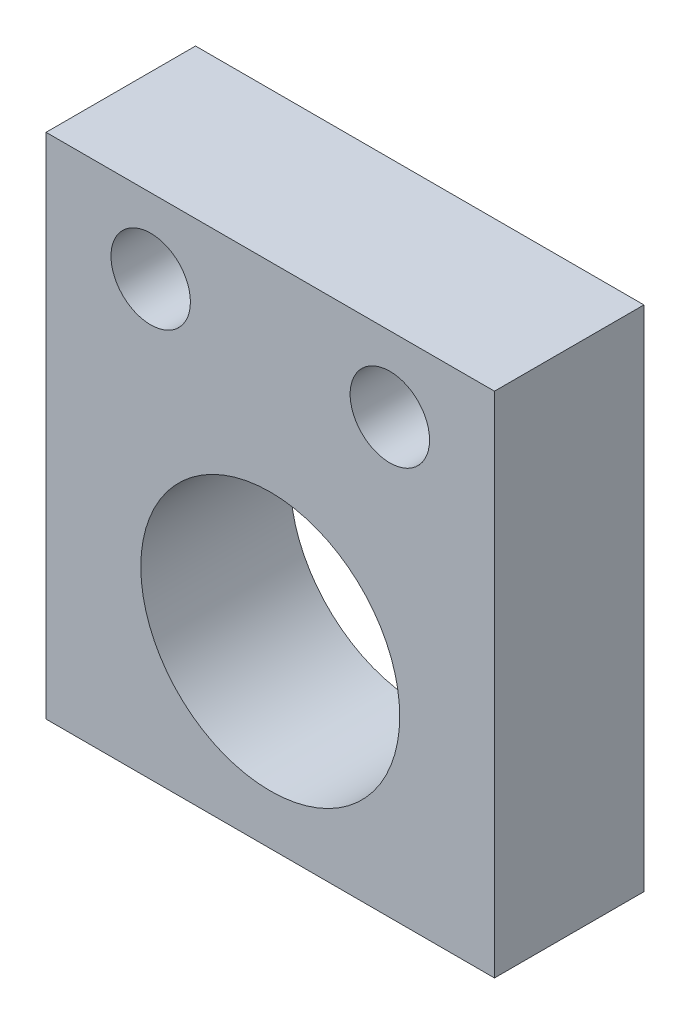
ISO-10303-21;
HEADER;
FILE_DESCRIPTION(('STEP AP214'),'2;1');
FILE_NAME('part.step','',(''),(''),'','','');
FILE_SCHEMA(('AUTOMOTIVE_DESIGN { 1 0 10303 214 1 1 1 1 }'));
ENDSEC;
DATA;
#1=APPLICATION_CONTEXT('core data for automotive mechanical design processes');
#2=APPLICATION_PROTOCOL_DEFINITION('international standard','automotive_design',2000,#1);
#3=PRODUCT_CONTEXT('',#1,'mechanical');
#4=PRODUCT('Part','Part','',(#3));
#5=PRODUCT_RELATED_PRODUCT_CATEGORY('part','',(#4));
#6=PRODUCT_DEFINITION_FORMATION('','',#4);
#7=PRODUCT_DEFINITION_CONTEXT('part definition',#1,'design');
#8=PRODUCT_DEFINITION('design','',#6,#7);
#9=PRODUCT_DEFINITION_SHAPE('','',#8);
#10=(LENGTH_UNIT() NAMED_UNIT(*) SI_UNIT(.MILLI.,.METRE.));
#11=(NAMED_UNIT(*) PLANE_ANGLE_UNIT() SI_UNIT($,.RADIAN.));
#12=(NAMED_UNIT(*) SI_UNIT($,.STERADIAN.) SOLID_ANGLE_UNIT());
#13=UNCERTAINTY_MEASURE_WITH_UNIT(LENGTH_MEASURE(1.E-05),#10,'distance_accuracy_value','');
#14=(GEOMETRIC_REPRESENTATION_CONTEXT(3) GLOBAL_UNCERTAINTY_ASSIGNED_CONTEXT((#13)) GLOBAL_UNIT_ASSIGNED_CONTEXT((#10,
#11,#12)) REPRESENTATION_CONTEXT('',''));
#15=CARTESIAN_POINT('',(0.,0.,0.));
#16=DIRECTION('',(0.,0.,1.));
#17=DIRECTION('',(1.,0.,0.));
#18=AXIS2_PLACEMENT_3D('',#15,#16,#17);
#19=CARTESIAN_POINT('',(0.,0.,-12.7));
#20=DIRECTION('',(-1.,0.,0.));
#21=DIRECTION('',(0.,0.,1.));
#22=AXIS2_PLACEMENT_3D('',#19,#20,#21);
#23=PLANE('',#22);
#24=DIRECTION('',(0.,-1.,0.));
#25=VECTOR('',#24,1.);
#26=CARTESIAN_POINT('',(0.,0.,0.));
#27=LINE('',#26,#25);
#28=CARTESIAN_POINT('',(0.,43.18,0.));
#29=VERTEX_POINT('',#28);
#30=CARTESIAN_POINT('',(0.,0.,0.));
#31=VERTEX_POINT('',#30);
#32=EDGE_CURVE('E114',#29,#31,#27,.T.);
#33=ORIENTED_EDGE('',*,*,#32,.F.);
#34=DIRECTION('',(0.,0.,1.));
#35=VECTOR('',#34,1.);
#36=CARTESIAN_POINT('',(0.,43.18,-12.7));
#37=LINE('',#36,#35);
#38=CARTESIAN_POINT('',(0.,43.18,-12.7));
#39=VERTEX_POINT('',#38);
#40=EDGE_CURVE('E11',#39,#29,#37,.T.);
#41=ORIENTED_EDGE('',*,*,#40,.F.);
#42=DIRECTION('',(0.,-1.,0.));
#43=VECTOR('',#42,1.);
#44=CARTESIAN_POINT('',(0.,0.,-12.7));
#45=LINE('',#44,#43);
#46=CARTESIAN_POINT('',(0.,0.,-12.7));
#47=VERTEX_POINT('',#46);
#48=EDGE_CURVE('E105',#39,#47,#45,.T.);
#49=ORIENTED_EDGE('',*,*,#48,.T.);
#50=DIRECTION('',(0.,0.,1.));
#51=VECTOR('',#50,1.);
#52=CARTESIAN_POINT('',(0.,0.,-12.7));
#53=LINE('',#52,#51);
#54=EDGE_CURVE('E46',#47,#31,#53,.T.);
#55=ORIENTED_EDGE('',*,*,#54,.T.);
#56=EDGE_LOOP('',(#33,#41,#49,#55));
#57=FACE_BOUND('',#56,.T.);
#58=ADVANCED_FACE('F43',(#57),#23,.T.);
#59=CARTESIAN_POINT('',(0.,43.18,-12.7));
#60=DIRECTION('',(0.,1.,0.));
#61=DIRECTION('',(0.,0.,1.));
#62=AXIS2_PLACEMENT_3D('',#59,#60,#61);
#63=PLANE('',#62);
#64=DIRECTION('',(-1.,0.,0.));
#65=VECTOR('',#64,1.);
#66=CARTESIAN_POINT('',(0.,43.18,0.));
#67=LINE('',#66,#65);
#68=CARTESIAN_POINT('',(38.1,43.18,0.));
#69=VERTEX_POINT('',#68);
#70=EDGE_CURVE('E108',#69,#29,#67,.T.);
#71=ORIENTED_EDGE('',*,*,#70,.F.);
#72=DIRECTION('',(0.,0.,1.));
#73=VECTOR('',#72,1.);
#74=CARTESIAN_POINT('',(38.1,43.18,-12.7));
#75=LINE('',#74,#73);
#76=CARTESIAN_POINT('',(38.1,43.18,-12.7));
#77=VERTEX_POINT('',#76);
#78=EDGE_CURVE('E53',#77,#69,#75,.T.);
#79=ORIENTED_EDGE('',*,*,#78,.F.);
#80=DIRECTION('',(-1.,0.,0.));
#81=VECTOR('',#80,1.);
#82=CARTESIAN_POINT('',(0.,43.18,-12.7));
#83=LINE('',#82,#81);
#84=EDGE_CURVE('E100',#77,#39,#83,.T.);
#85=ORIENTED_EDGE('',*,*,#84,.T.);
#86=ORIENTED_EDGE('',*,*,#40,.T.);
#87=EDGE_LOOP('',(#71,#79,#85,#86));
#88=FACE_BOUND('',#87,.T.);
#89=ADVANCED_FACE('F131',(#88),#63,.T.);
#90=CARTESIAN_POINT('',(38.1,0.,-12.7));
#91=DIRECTION('',(1.,0.,0.));
#92=DIRECTION('',(0.,0.,-1.));
#93=AXIS2_PLACEMENT_3D('',#90,#91,#92);
#94=PLANE('',#93);
#95=DIRECTION('',(0.,1.,0.));
#96=VECTOR('',#95,1.);
#97=CARTESIAN_POINT('',(38.1,0.,0.));
#98=LINE('',#97,#96);
#99=CARTESIAN_POINT('',(38.1,0.,0.));
#100=VERTEX_POINT('',#99);
#101=EDGE_CURVE('E94',#100,#69,#98,.T.);
#102=ORIENTED_EDGE('',*,*,#101,.F.);
#103=DIRECTION('',(0.,0.,1.));
#104=VECTOR('',#103,1.);
#105=CARTESIAN_POINT('',(38.1,0.,-12.7));
#106=LINE('',#105,#104);
#107=CARTESIAN_POINT('',(38.1,0.,-12.7));
#108=VERTEX_POINT('',#107);
#109=EDGE_CURVE('E89',#108,#100,#106,.T.);
#110=ORIENTED_EDGE('',*,*,#109,.F.);
#111=DIRECTION('',(0.,1.,0.));
#112=VECTOR('',#111,1.);
#113=CARTESIAN_POINT('',(38.1,0.,-12.7));
#114=LINE('',#113,#112);
#115=EDGE_CURVE('E92',#108,#77,#114,.T.);
#116=ORIENTED_EDGE('',*,*,#115,.T.);
#117=ORIENTED_EDGE('',*,*,#78,.T.);
#118=EDGE_LOOP('',(#102,#110,#116,#117));
#119=FACE_BOUND('',#118,.T.);
#120=ADVANCED_FACE('F91',(#119),#94,.T.);
#121=CARTESIAN_POINT('',(0.,0.,-12.7));
#122=DIRECTION('',(0.,-1.,0.));
#123=DIRECTION('',(0.,0.,-1.));
#124=AXIS2_PLACEMENT_3D('',#121,#122,#123);
#125=PLANE('',#124);
#126=DIRECTION('',(1.,0.,0.));
#127=VECTOR('',#126,1.);
#128=CARTESIAN_POINT('',(0.,0.,0.));
#129=LINE('',#128,#127);
#130=EDGE_CURVE('E118',#31,#100,#129,.T.);
#131=ORIENTED_EDGE('',*,*,#130,.F.);
#132=ORIENTED_EDGE('',*,*,#54,.F.);
#133=DIRECTION('',(1.,0.,0.));
#134=VECTOR('',#133,1.);
#135=CARTESIAN_POINT('',(0.,0.,-12.7));
#136=LINE('',#135,#134);
#137=EDGE_CURVE('E99',#47,#108,#136,.T.);
#138=ORIENTED_EDGE('',*,*,#137,.T.);
#139=ORIENTED_EDGE('',*,*,#109,.T.);
#140=EDGE_LOOP('',(#131,#132,#138,#139));
#141=FACE_BOUND('',#140,.T.);
#142=ADVANCED_FACE('F103',(#141),#125,.T.);
#143=CARTESIAN_POINT('',(0.,0.,-12.7));
#144=DIRECTION('',(0.,0.,-1.));
#145=DIRECTION('',(-1.,0.,0.));
#146=AXIS2_PLACEMENT_3D('',#143,#144,#145);
#147=PLANE('',#146);
#148=CARTESIAN_POINT('',(29.21,36.83,-12.7));
#149=DIRECTION('',(0.,0.,1.));
#150=DIRECTION('',(1.,0.,0.));
#151=AXIS2_PLACEMENT_3D('',#148,#149,#150);
#152=CIRCLE('',#151,3.37350099999999);
#153=CARTESIAN_POINT('',(32.583501,36.83,-12.7));
#154=VERTEX_POINT('',#153);
#155=EDGE_CURVE('E168',#154,#154,#152,.T.);
#156=ORIENTED_EDGE('',*,*,#155,.T.);
#157=EDGE_LOOP('',(#156));
#158=FACE_BOUND('',#157,.T.);
#159=CARTESIAN_POINT('',(8.89,36.83,-12.7));
#160=DIRECTION('',(0.,0.,1.));
#161=DIRECTION('',(1.,0.,0.));
#162=AXIS2_PLACEMENT_3D('',#159,#160,#161);
#163=CIRCLE('',#162,3.373501);
#164=CARTESIAN_POINT('',(12.263501,36.83,-12.7));
#165=VERTEX_POINT('',#164);
#166=EDGE_CURVE('E181',#165,#165,#163,.T.);
#167=ORIENTED_EDGE('',*,*,#166,.T.);
#168=EDGE_LOOP('',(#167));
#169=FACE_BOUND('',#168,.T.);
#170=CARTESIAN_POINT('',(19.05,15.24,-12.7));
#171=DIRECTION('',(0.,0.,1.));
#172=DIRECTION('',(1.,0.,0.));
#173=AXIS2_PLACEMENT_3D('',#170,#171,#172);
#174=CIRCLE('',#173,11.);
#175=CARTESIAN_POINT('',(30.05,15.24,-12.7));
#176=VERTEX_POINT('',#175);
#177=EDGE_CURVE('E119',#176,#176,#174,.T.);
#178=ORIENTED_EDGE('',*,*,#177,.T.);
#179=EDGE_LOOP('',(#178));
#180=FACE_BOUND('',#179,.T.);
#181=ORIENTED_EDGE('',*,*,#48,.F.);
#182=ORIENTED_EDGE('',*,*,#84,.F.);
#183=ORIENTED_EDGE('',*,*,#115,.F.);
#184=ORIENTED_EDGE('',*,*,#137,.F.);
#185=EDGE_LOOP('',(#181,#182,#183,#184));
#186=FACE_BOUND('',#185,.T.);
#187=ADVANCED_FACE('F98',(#158,#169,#180,#186),#147,.T.);
#188=CARTESIAN_POINT('',(0.,0.,0.));
#189=DIRECTION('',(0.,0.,-1.));
#190=DIRECTION('',(-1.,0.,0.));
#191=AXIS2_PLACEMENT_3D('',#188,#189,#190);
#192=PLANE('',#191);
#193=CARTESIAN_POINT('',(29.21,36.83,0.));
#194=DIRECTION('',(0.,0.,1.));
#195=DIRECTION('',(1.,0.,0.));
#196=AXIS2_PLACEMENT_3D('',#193,#194,#195);
#197=CIRCLE('',#196,3.373501);
#198=CARTESIAN_POINT('',(32.583501,36.83,0.));
#199=VERTEX_POINT('',#198);
#200=EDGE_CURVE('E171',#199,#199,#197,.T.);
#201=ORIENTED_EDGE('',*,*,#200,.F.);
#202=EDGE_LOOP('',(#201));
#203=FACE_BOUND('',#202,.T.);
#204=CARTESIAN_POINT('',(8.89,36.83,0.));
#205=DIRECTION('',(0.,0.,1.));
#206=DIRECTION('',(1.,0.,0.));
#207=AXIS2_PLACEMENT_3D('',#204,#205,#206);
#208=CIRCLE('',#207,3.373501);
#209=CARTESIAN_POINT('',(12.263501,36.83,0.));
#210=VERTEX_POINT('',#209);
#211=EDGE_CURVE('E175',#210,#210,#208,.T.);
#212=ORIENTED_EDGE('',*,*,#211,.F.);
#213=EDGE_LOOP('',(#212));
#214=FACE_BOUND('',#213,.T.);
#215=CARTESIAN_POINT('',(19.05,15.24,0.));
#216=DIRECTION('',(0.,0.,1.));
#217=DIRECTION('',(1.,0.,0.));
#218=AXIS2_PLACEMENT_3D('',#215,#216,#217);
#219=CIRCLE('',#218,11.);
#220=CARTESIAN_POINT('',(30.05,15.24,0.));
#221=VERTEX_POINT('',#220);
#222=EDGE_CURVE('E185',#221,#221,#219,.T.);
#223=ORIENTED_EDGE('',*,*,#222,.F.);
#224=EDGE_LOOP('',(#223));
#225=FACE_BOUND('',#224,.T.);
#226=ORIENTED_EDGE('',*,*,#32,.T.);
#227=ORIENTED_EDGE('',*,*,#130,.T.);
#228=ORIENTED_EDGE('',*,*,#101,.T.);
#229=ORIENTED_EDGE('',*,*,#70,.T.);
#230=EDGE_LOOP('',(#226,#227,#228,#229));
#231=FACE_BOUND('',#230,.T.);
#232=ADVANCED_FACE('F130',(#203,#214,#225,#231),#192,.F.);
#233=CARTESIAN_POINT('',(19.05,15.24,-12.7));
#234=DIRECTION('',(0.,0.,1.));
#235=DIRECTION('',(1.,0.,0.));
#236=AXIS2_PLACEMENT_3D('',#233,#234,#235);
#237=CYLINDRICAL_SURFACE('',#236,11.);
#238=ORIENTED_EDGE('',*,*,#177,.F.);
#239=EDGE_LOOP('',(#238));
#240=FACE_BOUND('',#239,.T.);
#241=ORIENTED_EDGE('',*,*,#222,.T.);
#242=EDGE_LOOP('',(#241));
#243=FACE_BOUND('',#242,.T.);
#244=ADVANCED_FACE('F149',(#240,#243),#237,.F.);
#245=CARTESIAN_POINT('',(8.89,36.83,0.));
#246=DIRECTION('',(0.,0.,1.));
#247=DIRECTION('',(1.,0.,0.));
#248=AXIS2_PLACEMENT_3D('',#245,#246,#247);
#249=CYLINDRICAL_SURFACE('',#248,3.373501);
#250=ORIENTED_EDGE('',*,*,#166,.F.);
#251=EDGE_LOOP('',(#250));
#252=FACE_BOUND('',#251,.T.);
#253=ORIENTED_EDGE('',*,*,#211,.T.);
#254=EDGE_LOOP('',(#253));
#255=FACE_BOUND('',#254,.T.);
#256=ADVANCED_FACE('F156',(#252,#255),#249,.F.);
#257=CARTESIAN_POINT('',(29.21,36.83,0.));
#258=DIRECTION('',(0.,0.,1.));
#259=DIRECTION('',(1.,0.,0.));
#260=AXIS2_PLACEMENT_3D('',#257,#258,#259);
#261=CYLINDRICAL_SURFACE('',#260,3.373501);
#262=ORIENTED_EDGE('',*,*,#155,.F.);
#263=EDGE_LOOP('',(#262));
#264=FACE_BOUND('',#263,.T.);
#265=ORIENTED_EDGE('',*,*,#200,.T.);
#266=EDGE_LOOP('',(#265));
#267=FACE_BOUND('',#266,.T.);
#268=ADVANCED_FACE('F160',(#264,#267),#261,.F.);
#269=CLOSED_SHELL('',(#58,#89,#120,#142,#187,#232,#244,#256,#268));
#270=MANIFOLD_SOLID_BREP('B2',#269);
#271=ADVANCED_BREP_SHAPE_REPRESENTATION('',(#18,#270),#14);
#272=SHAPE_DEFINITION_REPRESENTATION(#9,#271);
ENDSEC;
END-ISO-10303-21;
